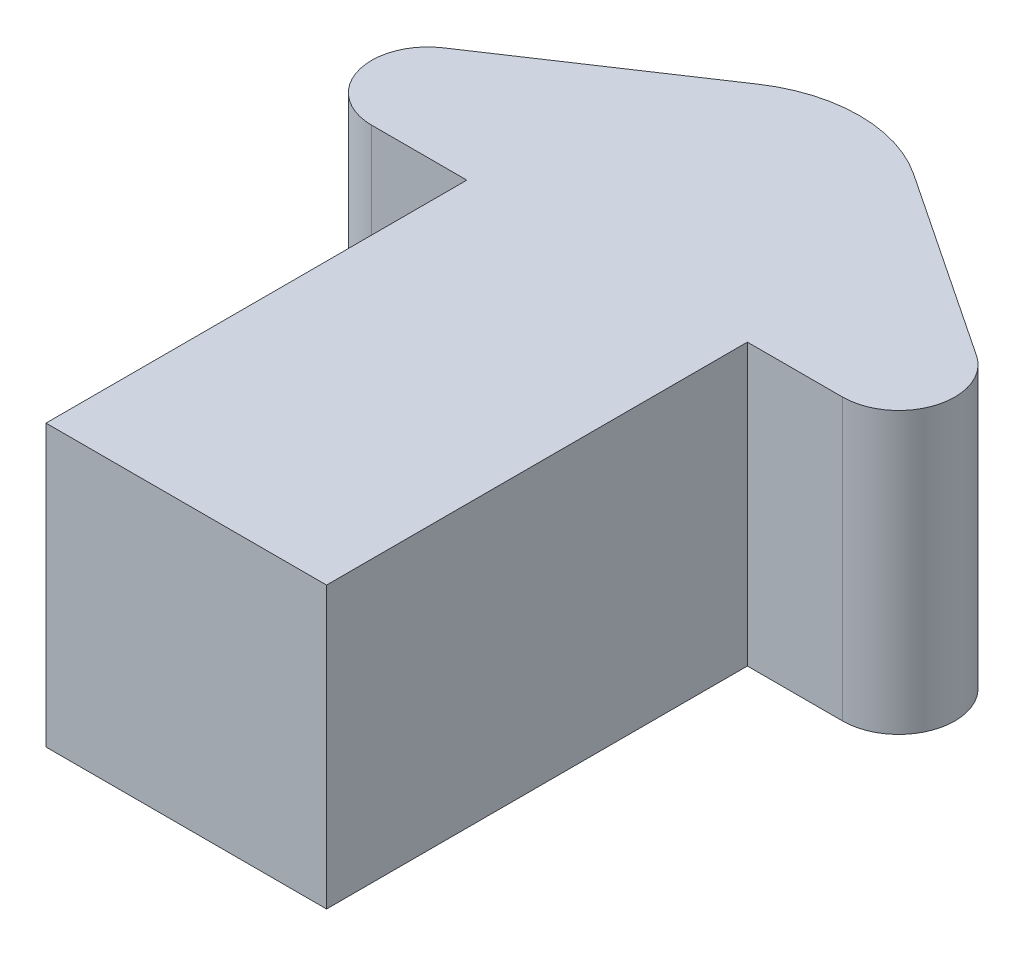
ISO-10303-21;
HEADER;
FILE_DESCRIPTION(('STEP AP214'),'2;1');
FILE_NAME('part.step','',(''),(''),'','','');
FILE_SCHEMA(('AUTOMOTIVE_DESIGN { 1 0 10303 214 1 1 1 1 }'));
ENDSEC;
DATA;
#1=APPLICATION_CONTEXT('core data for automotive mechanical design processes');
#2=APPLICATION_PROTOCOL_DEFINITION('international standard','automotive_design',2000,#1);
#3=PRODUCT_CONTEXT('',#1,'mechanical');
#4=PRODUCT('Part','Part','',(#3));
#5=PRODUCT_RELATED_PRODUCT_CATEGORY('part','',(#4));
#6=PRODUCT_DEFINITION_FORMATION('','',#4);
#7=PRODUCT_DEFINITION_CONTEXT('part definition',#1,'design');
#8=PRODUCT_DEFINITION('design','',#6,#7);
#9=PRODUCT_DEFINITION_SHAPE('','',#8);
#10=(LENGTH_UNIT() NAMED_UNIT(*) SI_UNIT(.MILLI.,.METRE.));
#11=(NAMED_UNIT(*) PLANE_ANGLE_UNIT() SI_UNIT($,.RADIAN.));
#12=(NAMED_UNIT(*) SI_UNIT($,.STERADIAN.) SOLID_ANGLE_UNIT());
#13=UNCERTAINTY_MEASURE_WITH_UNIT(LENGTH_MEASURE(1.E-05),#10,'distance_accuracy_value','');
#14=(GEOMETRIC_REPRESENTATION_CONTEXT(3) GLOBAL_UNCERTAINTY_ASSIGNED_CONTEXT((#13)) GLOBAL_UNIT_ASSIGNED_CONTEXT((#10,
#11,#12)) REPRESENTATION_CONTEXT('',''));
#15=CARTESIAN_POINT('',(0.,0.,0.));
#16=DIRECTION('',(0.,0.,1.));
#17=DIRECTION('',(1.,0.,0.));
#18=AXIS2_PLACEMENT_3D('',#15,#16,#17);
#19=CARTESIAN_POINT('',(9.91379310344828,10.,0.));
#20=DIRECTION('',(1.,0.,0.));
#21=DIRECTION('',(0.,0.,-1.));
#22=AXIS2_PLACEMENT_3D('',#19,#20,#21);
#23=PLANE('',#22);
#24=DIRECTION('',(0.,0.,1.));
#25=VECTOR('',#24,1.);
#26=CARTESIAN_POINT('',(9.91379310344828,0.,0.));
#27=LINE('',#26,#25);
#28=CARTESIAN_POINT('',(9.91379310344827,0.,-14.9568965517241));
#29=VERTEX_POINT('',#28);
#30=CARTESIAN_POINT('',(9.91379310344828,0.,0.0431034482758583));
#31=VERTEX_POINT('',#30);
#32=EDGE_CURVE('E135',#29,#31,#27,.T.);
#33=ORIENTED_EDGE('',*,*,#32,.F.);
#34=DIRECTION('',(0.,-1.,0.));
#35=VECTOR('',#34,1.);
#36=CARTESIAN_POINT('',(9.91379310344827,10.,-14.9568965517241));
#37=LINE('',#36,#35);
#38=CARTESIAN_POINT('',(9.91379310344827,10.,-14.9568965517241));
#39=VERTEX_POINT('',#38);
#40=EDGE_CURVE('E122',#39,#29,#37,.T.);
#41=ORIENTED_EDGE('',*,*,#40,.F.);
#42=DIRECTION('',(0.,0.,1.));
#43=VECTOR('',#42,1.);
#44=CARTESIAN_POINT('',(9.91379310344828,10.,0.));
#45=LINE('',#44,#43);
#46=CARTESIAN_POINT('',(9.91379310344828,10.,0.0431034482758583));
#47=VERTEX_POINT('',#46);
#48=EDGE_CURVE('E130',#39,#47,#45,.T.);
#49=ORIENTED_EDGE('',*,*,#48,.T.);
#50=DIRECTION('',(0.,-1.,0.));
#51=VECTOR('',#50,1.);
#52=CARTESIAN_POINT('',(9.91379310344828,10.,0.0431034482758583));
#53=LINE('',#52,#51);
#54=EDGE_CURVE('E158',#47,#31,#53,.T.);
#55=ORIENTED_EDGE('',*,*,#54,.T.);
#56=EDGE_LOOP('',(#33,#41,#49,#55));
#57=FACE_BOUND('',#56,.T.);
#58=ADVANCED_FACE('F41',(#57),#23,.T.);
#59=CARTESIAN_POINT('',(0.,10.,-14.9568965517241));
#60=DIRECTION('',(0.,0.,1.));
#61=DIRECTION('',(1.,0.,0.));
#62=AXIS2_PLACEMENT_3D('',#59,#60,#61);
#63=PLANE('',#62);
#64=DIRECTION('',(-1.,0.,0.));
#65=VECTOR('',#64,1.);
#66=CARTESIAN_POINT('',(0.,0.,-14.9568965517241));
#67=LINE('',#66,#65);
#68=CARTESIAN_POINT('',(13.3082418279843,0.,-14.9568965517241));
#69=VERTEX_POINT('',#68);
#70=EDGE_CURVE('E160',#69,#29,#67,.T.);
#71=ORIENTED_EDGE('',*,*,#70,.F.);
#72=DIRECTION('',(0.,-1.,0.));
#73=VECTOR('',#72,1.);
#74=CARTESIAN_POINT('',(13.3082418279843,10.,-14.9568965517241));
#75=LINE('',#74,#73);
#76=CARTESIAN_POINT('',(13.3082418279843,10.,-14.9568965517241));
#77=VERTEX_POINT('',#76);
#78=EDGE_CURVE('E125',#69,#77,#75,.F.);
#79=ORIENTED_EDGE('',*,*,#78,.T.);
#80=DIRECTION('',(-1.,0.,0.));
#81=VECTOR('',#80,1.);
#82=CARTESIAN_POINT('',(0.,10.,-14.9568965517241));
#83=LINE('',#82,#81);
#84=EDGE_CURVE('E118',#77,#39,#83,.T.);
#85=ORIENTED_EDGE('',*,*,#84,.T.);
#86=ORIENTED_EDGE('',*,*,#40,.T.);
#87=EDGE_LOOP('',(#71,#79,#85,#86));
#88=FACE_BOUND('',#87,.T.);
#89=ADVANCED_FACE('F121',(#88),#63,.T.);
#90=CARTESIAN_POINT('',(13.0305039787798,10.,-19.5457559681698));
#91=DIRECTION('',(-0.554700196225229,0.,0.832050294337844));
#92=DIRECTION('',(0.832050294337844,0.,0.554700196225229));
#93=AXIS2_PLACEMENT_3D('',#90,#91,#92);
#94=PLANE('',#93);
#95=DIRECTION('',(-0.832050294337844,0.,-0.554700196225229));
#96=VECTOR('',#95,1.);
#97=CARTESIAN_POINT('',(13.0305039787798,0.,-19.5457559681698));
#98=LINE('',#97,#96);
#99=CARTESIAN_POINT('',(14.4176422204347,0.,-18.6209971403998));
#100=VERTEX_POINT('',#99);
#101=CARTESIAN_POINT('',(7.68729408457442,0.,-23.10789589764));
#102=VERTEX_POINT('',#101);
#103=EDGE_CURVE('E162',#100,#102,#98,.T.);
#104=ORIENTED_EDGE('',*,*,#103,.T.);
#105=DIRECTION('',(0.,-1.,0.));
#106=VECTOR('',#105,1.);
#107=CARTESIAN_POINT('',(7.68729408457442,10.,-23.10789589764));
#108=LINE('',#107,#106);
#109=CARTESIAN_POINT('',(7.68729408457442,10.,-23.10789589764));
#110=VERTEX_POINT('',#109);
#111=EDGE_CURVE('E49',#102,#110,#108,.F.);
#112=ORIENTED_EDGE('',*,*,#111,.T.);
#113=DIRECTION('',(-0.832050294337844,0.,-0.554700196225229));
#114=VECTOR('',#113,1.);
#115=CARTESIAN_POINT('',(13.0305039787798,10.,-19.5457559681698));
#116=LINE('',#115,#114);
#117=CARTESIAN_POINT('',(14.4176422204347,10.,-18.6209971403998));
#118=VERTEX_POINT('',#117);
#119=EDGE_CURVE('E129',#118,#110,#116,.T.);
#120=ORIENTED_EDGE('',*,*,#119,.F.);
#121=DIRECTION('',(0.,-1.,0.));
#122=VECTOR('',#121,1.);
#123=CARTESIAN_POINT('',(14.4176422204347,0.,-18.6209971403998));
#124=LINE('',#123,#122);
#125=EDGE_CURVE('E187',#118,#100,#124,.T.);
#126=ORIENTED_EDGE('',*,*,#125,.T.);
#127=EDGE_LOOP('',(#104,#112,#120,#126));
#128=FACE_BOUND('',#127,.T.);
#129=ADVANCED_FACE('F228',(#128),#94,.F.);
#130=CARTESIAN_POINT('',(-10.0066312997347,10.,-15.0099469496021));
#131=DIRECTION('',(-0.554700196225229,0.,-0.832050294337844));
#132=DIRECTION('',(-0.832050294337844,0.,0.554700196225229));
#133=AXIS2_PLACEMENT_3D('',#130,#131,#132);
#134=PLANE('',#133);
#135=DIRECTION('',(0.832050294337844,0.,-0.554700196225229));
#136=VECTOR('',#135,1.);
#137=CARTESIAN_POINT('',(-10.0066312997347,10.,-15.0099469496021));
#138=LINE('',#137,#136);
#139=CARTESIAN_POINT('',(-4.59005601353819,10.,-18.6209971403998));
#140=VERTEX_POINT('',#139);
#141=CARTESIAN_POINT('',(2.14029212232213,10.,-23.10789589764));
#142=VERTEX_POINT('',#141);
#143=EDGE_CURVE('E150',#140,#142,#138,.T.);
#144=ORIENTED_EDGE('',*,*,#143,.T.);
#145=DIRECTION('',(0.,-1.,0.));
#146=VECTOR('',#145,1.);
#147=CARTESIAN_POINT('',(2.14029212232213,0.,-23.10789589764));
#148=LINE('',#147,#146);
#149=CARTESIAN_POINT('',(2.14029212232213,0.,-23.10789589764));
#150=VERTEX_POINT('',#149);
#151=EDGE_CURVE('E191',#142,#150,#148,.T.);
#152=ORIENTED_EDGE('',*,*,#151,.T.);
#153=DIRECTION('',(0.832050294337844,0.,-0.554700196225229));
#154=VECTOR('',#153,1.);
#155=CARTESIAN_POINT('',(-10.0066312997347,0.,-15.0099469496021));
#156=LINE('',#155,#154);
#157=CARTESIAN_POINT('',(-4.59005601353819,0.,-18.6209971403998));
#158=VERTEX_POINT('',#157);
#159=EDGE_CURVE('E164',#158,#150,#156,.T.);
#160=ORIENTED_EDGE('',*,*,#159,.F.);
#161=DIRECTION('',(0.,-1.,0.));
#162=VECTOR('',#161,1.);
#163=CARTESIAN_POINT('',(-4.59005601353819,10.,-18.6209971403998));
#164=LINE('',#163,#162);
#165=EDGE_CURVE('E181',#158,#140,#164,.F.);
#166=ORIENTED_EDGE('',*,*,#165,.T.);
#167=EDGE_LOOP('',(#144,#152,#160,#166));
#168=FACE_BOUND('',#167,.T.);
#169=ADVANCED_FACE('F197',(#168),#134,.T.);
#170=CARTESIAN_POINT('',(0.,10.,-14.9568965517241));
#171=DIRECTION('',(0.,0.,-1.));
#172=DIRECTION('',(-1.,0.,0.));
#173=AXIS2_PLACEMENT_3D('',#170,#171,#172);
#174=PLANE('',#173);
#175=DIRECTION('',(1.,0.,0.));
#176=VECTOR('',#175,1.);
#177=CARTESIAN_POINT('',(0.,10.,-14.9568965517241));
#178=LINE('',#177,#176);
#179=CARTESIAN_POINT('',(-3.48065562108773,10.,-14.9568965517241));
#180=VERTEX_POINT('',#179);
#181=CARTESIAN_POINT('',(-0.0862068965517271,10.,-14.9568965517241));
#182=VERTEX_POINT('',#181);
#183=EDGE_CURVE('E153',#180,#182,#178,.T.);
#184=ORIENTED_EDGE('',*,*,#183,.F.);
#185=DIRECTION('',(0.,-1.,0.));
#186=VECTOR('',#185,1.);
#187=CARTESIAN_POINT('',(-3.48065562108773,0.,-14.9568965517241));
#188=LINE('',#187,#186);
#189=CARTESIAN_POINT('',(-3.48065562108773,0.,-14.9568965517241));
#190=VERTEX_POINT('',#189);
#191=EDGE_CURVE('E136',#180,#190,#188,.T.);
#192=ORIENTED_EDGE('',*,*,#191,.T.);
#193=DIRECTION('',(1.,0.,0.));
#194=VECTOR('',#193,1.);
#195=CARTESIAN_POINT('',(0.,0.,-14.9568965517241));
#196=LINE('',#195,#194);
#197=CARTESIAN_POINT('',(-0.0862068965517271,0.,-14.9568965517241));
#198=VERTEX_POINT('',#197);
#199=EDGE_CURVE('E166',#190,#198,#196,.T.);
#200=ORIENTED_EDGE('',*,*,#199,.T.);
#201=DIRECTION('',(0.,-1.,0.));
#202=VECTOR('',#201,1.);
#203=CARTESIAN_POINT('',(-0.0862068965517271,10.,-14.9568965517241));
#204=LINE('',#203,#202);
#205=EDGE_CURVE('E137',#182,#198,#204,.T.);
#206=ORIENTED_EDGE('',*,*,#205,.F.);
#207=EDGE_LOOP('',(#184,#192,#200,#206));
#208=FACE_BOUND('',#207,.T.);
#209=ADVANCED_FACE('F211',(#208),#174,.F.);
#210=CARTESIAN_POINT('',(-0.0862068965517236,10.,0.));
#211=DIRECTION('',(1.,0.,0.));
#212=DIRECTION('',(0.,0.,-1.));
#213=AXIS2_PLACEMENT_3D('',#210,#211,#212);
#214=PLANE('',#213);
#215=DIRECTION('',(0.,0.,1.));
#216=VECTOR('',#215,1.);
#217=CARTESIAN_POINT('',(-0.0862068965517236,0.,0.));
#218=LINE('',#217,#216);
#219=CARTESIAN_POINT('',(-0.0862068965517236,0.,0.0431034482758583));
#220=VERTEX_POINT('',#219);
#221=EDGE_CURVE('E146',#198,#220,#218,.T.);
#222=ORIENTED_EDGE('',*,*,#221,.T.);
#223=DIRECTION('',(0.,-1.,0.));
#224=VECTOR('',#223,1.);
#225=CARTESIAN_POINT('',(-0.0862068965517236,10.,0.0431034482758583));
#226=LINE('',#225,#224);
#227=CARTESIAN_POINT('',(-0.0862068965517236,10.,0.0431034482758583));
#228=VERTEX_POINT('',#227);
#229=EDGE_CURVE('E170',#228,#220,#226,.T.);
#230=ORIENTED_EDGE('',*,*,#229,.F.);
#231=DIRECTION('',(0.,0.,1.));
#232=VECTOR('',#231,1.);
#233=CARTESIAN_POINT('',(-0.0862068965517236,10.,0.));
#234=LINE('',#233,#232);
#235=EDGE_CURVE('E155',#182,#228,#234,.T.);
#236=ORIENTED_EDGE('',*,*,#235,.F.);
#237=ORIENTED_EDGE('',*,*,#205,.T.);
#238=EDGE_LOOP('',(#222,#230,#236,#237));
#239=FACE_BOUND('',#238,.T.);
#240=ADVANCED_FACE('F245',(#239),#214,.F.);
#241=CARTESIAN_POINT('',(0.,10.,0.0431034482758583));
#242=DIRECTION('',(0.,0.,-1.));
#243=DIRECTION('',(-1.,0.,0.));
#244=AXIS2_PLACEMENT_3D('',#241,#242,#243);
#245=PLANE('',#244);
#246=DIRECTION('',(1.,0.,0.));
#247=VECTOR('',#246,1.);
#248=CARTESIAN_POINT('',(0.,0.,0.0431034482758583));
#249=LINE('',#248,#247);
#250=EDGE_CURVE('E143',#220,#31,#249,.T.);
#251=ORIENTED_EDGE('',*,*,#250,.T.);
#252=ORIENTED_EDGE('',*,*,#54,.F.);
#253=DIRECTION('',(1.,0.,0.));
#254=VECTOR('',#253,1.);
#255=CARTESIAN_POINT('',(0.,10.,0.0431034482758583));
#256=LINE('',#255,#254);
#257=EDGE_CURVE('E141',#228,#47,#256,.T.);
#258=ORIENTED_EDGE('',*,*,#257,.F.);
#259=ORIENTED_EDGE('',*,*,#229,.T.);
#260=EDGE_LOOP('',(#251,#252,#258,#259));
#261=FACE_BOUND('',#260,.T.);
#262=ADVANCED_FACE('F240',(#261),#245,.F.);
#263=CARTESIAN_POINT('',(0.,10.,0.));
#264=DIRECTION('',(0.,1.,0.));
#265=DIRECTION('',(0.,0.,1.));
#266=AXIS2_PLACEMENT_3D('',#263,#264,#265);
#267=PLANE('',#266);
#268=ORIENTED_EDGE('',*,*,#119,.T.);
#269=CARTESIAN_POINT('',(4.91379310344827,10.,-18.9476444259508));
#270=DIRECTION('',(0.,1.,0.));
#271=DIRECTION('',(0.,0.,1.));
#272=AXIS2_PLACEMENT_3D('',#269,#270,#271);
#273=CIRCLE('',#272,5.);
#274=EDGE_CURVE('E11',#110,#142,#273,.T.);
#275=ORIENTED_EDGE('',*,*,#274,.T.);
#276=ORIENTED_EDGE('',*,*,#143,.F.);
#277=CARTESIAN_POINT('',(-3.48065562108773,10.,-16.9568965517241));
#278=DIRECTION('',(0.,1.,0.));
#279=DIRECTION('',(0.,0.,1.));
#280=AXIS2_PLACEMENT_3D('',#277,#278,#279);
#281=CIRCLE('',#280,2.);
#282=EDGE_CURVE('E185',#140,#180,#281,.T.);
#283=ORIENTED_EDGE('',*,*,#282,.T.);
#284=ORIENTED_EDGE('',*,*,#183,.T.);
#285=ORIENTED_EDGE('',*,*,#235,.T.);
#286=ORIENTED_EDGE('',*,*,#257,.T.);
#287=ORIENTED_EDGE('',*,*,#48,.F.);
#288=ORIENTED_EDGE('',*,*,#84,.F.);
#289=CARTESIAN_POINT('',(13.3082418279843,10.,-16.9568965517241));
#290=DIRECTION('',(0.,1.,0.));
#291=DIRECTION('',(0.,0.,1.));
#292=AXIS2_PLACEMENT_3D('',#289,#290,#291);
#293=CIRCLE('',#292,2.);
#294=EDGE_CURVE('E183',#77,#118,#293,.T.);
#295=ORIENTED_EDGE('',*,*,#294,.T.);
#296=EDGE_LOOP('',(#268,#275,#276,#283,#284,#285,#286,#287,#288,#295));
#297=FACE_BOUND('',#296,.T.);
#298=ADVANCED_FACE('F139',(#297),#267,.T.);
#299=CARTESIAN_POINT('',(0.,0.,0.));
#300=DIRECTION('',(0.,1.,0.));
#301=DIRECTION('',(0.,0.,1.));
#302=AXIS2_PLACEMENT_3D('',#299,#300,#301);
#303=PLANE('',#302);
#304=ORIENTED_EDGE('',*,*,#159,.T.);
#305=CARTESIAN_POINT('',(4.91379310344827,0.,-18.9476444259508));
#306=DIRECTION('',(0.,1.,0.));
#307=DIRECTION('',(0.,0.,1.));
#308=AXIS2_PLACEMENT_3D('',#305,#306,#307);
#309=CIRCLE('',#308,5.);
#310=EDGE_CURVE('E63',#150,#102,#309,.F.);
#311=ORIENTED_EDGE('',*,*,#310,.T.);
#312=ORIENTED_EDGE('',*,*,#103,.F.);
#313=CARTESIAN_POINT('',(13.3082418279843,0.,-16.9568965517241));
#314=DIRECTION('',(0.,1.,0.));
#315=DIRECTION('',(0.,0.,1.));
#316=AXIS2_PLACEMENT_3D('',#313,#314,#315);
#317=CIRCLE('',#316,2.);
#318=EDGE_CURVE('E177',#100,#69,#317,.F.);
#319=ORIENTED_EDGE('',*,*,#318,.T.);
#320=ORIENTED_EDGE('',*,*,#70,.T.);
#321=ORIENTED_EDGE('',*,*,#32,.T.);
#322=ORIENTED_EDGE('',*,*,#250,.F.);
#323=ORIENTED_EDGE('',*,*,#221,.F.);
#324=ORIENTED_EDGE('',*,*,#199,.F.);
#325=CARTESIAN_POINT('',(-3.48065562108773,0.,-16.9568965517241));
#326=DIRECTION('',(0.,1.,0.));
#327=DIRECTION('',(0.,0.,1.));
#328=AXIS2_PLACEMENT_3D('',#325,#326,#327);
#329=CIRCLE('',#328,2.);
#330=EDGE_CURVE('E179',#190,#158,#329,.F.);
#331=ORIENTED_EDGE('',*,*,#330,.T.);
#332=EDGE_LOOP('',(#304,#311,#312,#319,#320,#321,#322,#323,#324,#331));
#333=FACE_BOUND('',#332,.T.);
#334=ADVANCED_FACE('F202',(#333),#303,.F.);
#335=CARTESIAN_POINT('',(-3.48065562108773,10.,-16.9568965517241));
#336=DIRECTION('',(0.,1.,0.));
#337=DIRECTION('',(0.,0.,1.));
#338=AXIS2_PLACEMENT_3D('',#335,#336,#337);
#339=CYLINDRICAL_SURFACE('',#338,2.);
#340=ORIENTED_EDGE('',*,*,#282,.F.);
#341=ORIENTED_EDGE('',*,*,#165,.F.);
#342=ORIENTED_EDGE('',*,*,#330,.F.);
#343=ORIENTED_EDGE('',*,*,#191,.F.);
#344=EDGE_LOOP('',(#340,#341,#342,#343));
#345=FACE_BOUND('',#344,.T.);
#346=ADVANCED_FACE('F208',(#345),#339,.T.);
#347=CARTESIAN_POINT('',(13.3082418279843,10.,-16.9568965517241));
#348=DIRECTION('',(0.,1.,0.));
#349=DIRECTION('',(0.,0.,1.));
#350=AXIS2_PLACEMENT_3D('',#347,#348,#349);
#351=CYLINDRICAL_SURFACE('',#350,2.);
#352=ORIENTED_EDGE('',*,*,#294,.F.);
#353=ORIENTED_EDGE('',*,*,#78,.F.);
#354=ORIENTED_EDGE('',*,*,#318,.F.);
#355=ORIENTED_EDGE('',*,*,#125,.F.);
#356=EDGE_LOOP('',(#352,#353,#354,#355));
#357=FACE_BOUND('',#356,.T.);
#358=ADVANCED_FACE('F216',(#357),#351,.T.);
#359=CARTESIAN_POINT('',(4.91379310344827,10.,-18.9476444259508));
#360=DIRECTION('',(0.,1.,0.));
#361=DIRECTION('',(0.,0.,1.));
#362=AXIS2_PLACEMENT_3D('',#359,#360,#361);
#363=CYLINDRICAL_SURFACE('',#362,5.);
#364=ORIENTED_EDGE('',*,*,#274,.F.);
#365=ORIENTED_EDGE('',*,*,#111,.F.);
#366=ORIENTED_EDGE('',*,*,#310,.F.);
#367=ORIENTED_EDGE('',*,*,#151,.F.);
#368=EDGE_LOOP('',(#364,#365,#366,#367));
#369=FACE_BOUND('',#368,.T.);
#370=ADVANCED_FACE('F43',(#369),#363,.T.);
#371=CLOSED_SHELL('',(#58,#89,#129,#169,#209,#240,#262,#298,#334,#346,#358,#370));
#372=MANIFOLD_SOLID_BREP('B2',#371);
#373=ADVANCED_BREP_SHAPE_REPRESENTATION('',(#18,#372),#14);
#374=SHAPE_DEFINITION_REPRESENTATION(#9,#373);
ENDSEC;
END-ISO-10303-21;
